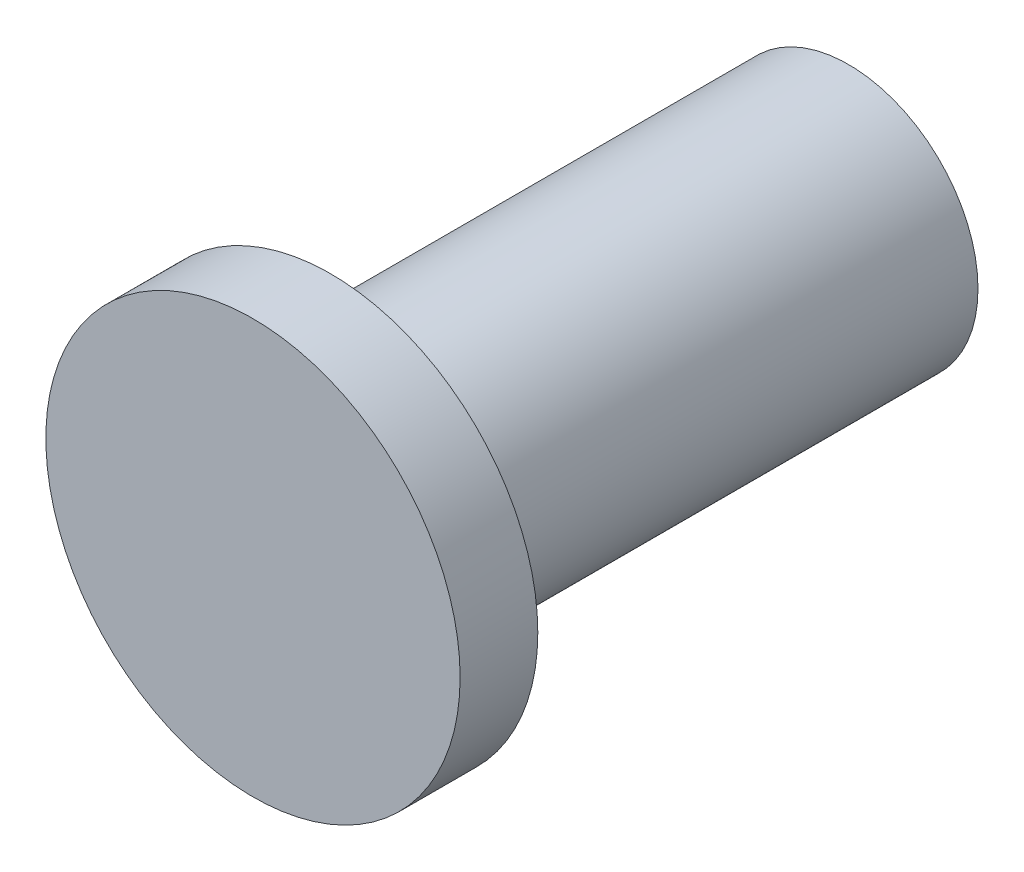
ISO-10303-21;
HEADER;
FILE_DESCRIPTION(('STEP AP214'),'2;1');
FILE_NAME('part.step','',(''),(''),'','','');
FILE_SCHEMA(('AUTOMOTIVE_DESIGN { 1 0 10303 214 1 1 1 1 }'));
ENDSEC;
DATA;
#1=APPLICATION_CONTEXT('core data for automotive mechanical design processes');
#2=APPLICATION_PROTOCOL_DEFINITION('international standard','automotive_design',2000,#1);
#3=PRODUCT_CONTEXT('',#1,'mechanical');
#4=PRODUCT('Part','Part','',(#3));
#5=PRODUCT_RELATED_PRODUCT_CATEGORY('part','',(#4));
#6=PRODUCT_DEFINITION_FORMATION('','',#4);
#7=PRODUCT_DEFINITION_CONTEXT('part definition',#1,'design');
#8=PRODUCT_DEFINITION('design','',#6,#7);
#9=PRODUCT_DEFINITION_SHAPE('','',#8);
#10=(LENGTH_UNIT() NAMED_UNIT(*) SI_UNIT(.MILLI.,.METRE.));
#11=(NAMED_UNIT(*) PLANE_ANGLE_UNIT() SI_UNIT($,.RADIAN.));
#12=(NAMED_UNIT(*) SI_UNIT($,.STERADIAN.) SOLID_ANGLE_UNIT());
#13=UNCERTAINTY_MEASURE_WITH_UNIT(LENGTH_MEASURE(1.E-05),#10,'distance_accuracy_value','');
#14=(GEOMETRIC_REPRESENTATION_CONTEXT(3) GLOBAL_UNCERTAINTY_ASSIGNED_CONTEXT((#13)) GLOBAL_UNIT_ASSIGNED_CONTEXT((#10,
#11,#12)) REPRESENTATION_CONTEXT('',''));
#15=CARTESIAN_POINT('',(0.,0.,0.));
#16=DIRECTION('',(0.,0.,1.));
#17=DIRECTION('',(1.,0.,0.));
#18=AXIS2_PLACEMENT_3D('',#15,#16,#17);
#19=CARTESIAN_POINT('',(0.,0.,3.));
#20=DIRECTION('',(0.,0.,-1.));
#21=DIRECTION('',(-1.,0.,0.));
#22=AXIS2_PLACEMENT_3D('',#19,#20,#21);
#23=CYLINDRICAL_SURFACE('',#22,8.);
#24=CARTESIAN_POINT('',(0.,0.,3.));
#25=DIRECTION('',(0.,0.,1.));
#26=DIRECTION('',(1.,0.,0.));
#27=AXIS2_PLACEMENT_3D('',#24,#25,#26);
#28=CIRCLE('',#27,8.);
#29=CARTESIAN_POINT('',(8.,0.,3.));
#30=VERTEX_POINT('',#29);
#31=EDGE_CURVE('E45',#30,#30,#28,.T.);
#32=ORIENTED_EDGE('',*,*,#31,.F.);
#33=EDGE_LOOP('',(#32));
#34=FACE_BOUND('',#33,.T.);
#35=CARTESIAN_POINT('',(0.,0.,0.));
#36=DIRECTION('',(0.,0.,1.));
#37=DIRECTION('',(1.,0.,0.));
#38=AXIS2_PLACEMENT_3D('',#35,#36,#37);
#39=CIRCLE('',#38,8.);
#40=CARTESIAN_POINT('',(8.,0.,0.));
#41=VERTEX_POINT('',#40);
#42=EDGE_CURVE('E40',#41,#41,#39,.T.);
#43=ORIENTED_EDGE('',*,*,#42,.T.);
#44=EDGE_LOOP('',(#43));
#45=FACE_BOUND('',#44,.T.);
#46=ADVANCED_FACE('F37',(#34,#45),#23,.T.);
#47=CARTESIAN_POINT('',(0.,0.,3.));
#48=DIRECTION('',(0.,0.,1.));
#49=DIRECTION('',(1.,0.,0.));
#50=AXIS2_PLACEMENT_3D('',#47,#48,#49);
#51=PLANE('',#50);
#52=ORIENTED_EDGE('',*,*,#31,.T.);
#53=EDGE_LOOP('',(#52));
#54=FACE_BOUND('',#53,.T.);
#55=ADVANCED_FACE('F65',(#54),#51,.T.);
#56=CARTESIAN_POINT('',(0.,0.,0.));
#57=DIRECTION('',(0.,0.,1.));
#58=DIRECTION('',(1.,0.,0.));
#59=AXIS2_PLACEMENT_3D('',#56,#57,#58);
#60=PLANE('',#59);
#61=CARTESIAN_POINT('',(0.,0.,0.));
#62=DIRECTION('',(0.,0.,-1.));
#63=DIRECTION('',(-1.,0.,0.));
#64=AXIS2_PLACEMENT_3D('',#61,#62,#63);
#65=CIRCLE('',#64,5.);
#66=CARTESIAN_POINT('',(-5.,0.,0.));
#67=VERTEX_POINT('',#66);
#68=EDGE_CURVE('E10',#67,#67,#65,.T.);
#69=ORIENTED_EDGE('',*,*,#68,.F.);
#70=EDGE_LOOP('',(#69));
#71=FACE_BOUND('',#70,.T.);
#72=ORIENTED_EDGE('',*,*,#42,.F.);
#73=EDGE_LOOP('',(#72));
#74=FACE_BOUND('',#73,.T.);
#75=ADVANCED_FACE('F62',(#71,#74),#60,.F.);
#76=CARTESIAN_POINT('',(0.,0.,-10.));
#77=DIRECTION('',(0.,0.,1.));
#78=DIRECTION('',(1.,0.,0.));
#79=AXIS2_PLACEMENT_3D('',#76,#77,#78);
#80=CYLINDRICAL_SURFACE('',#79,5.);
#81=ORIENTED_EDGE('',*,*,#68,.T.);
#82=EDGE_LOOP('',(#81));
#83=FACE_BOUND('',#82,.T.);
#84=CARTESIAN_POINT('',(0.,0.,-20.));
#85=DIRECTION('',(0.,0.,-1.));
#86=DIRECTION('',(-1.,0.,0.));
#87=AXIS2_PLACEMENT_3D('',#84,#85,#86);
#88=CIRCLE('',#87,5.);
#89=CARTESIAN_POINT('',(-5.,0.,-20.));
#90=VERTEX_POINT('',#89);
#91=EDGE_CURVE('E52',#90,#90,#88,.T.);
#92=ORIENTED_EDGE('',*,*,#91,.F.);
#93=EDGE_LOOP('',(#92));
#94=FACE_BOUND('',#93,.T.);
#95=ADVANCED_FACE('F64',(#83,#94),#80,.T.);
#96=CARTESIAN_POINT('',(0.,0.,-20.));
#97=DIRECTION('',(0.,0.,-1.));
#98=DIRECTION('',(-1.,0.,0.));
#99=AXIS2_PLACEMENT_3D('',#96,#97,#98);
#100=PLANE('',#99);
#101=ORIENTED_EDGE('',*,*,#91,.T.);
#102=EDGE_LOOP('',(#101));
#103=FACE_BOUND('',#102,.T.);
#104=ADVANCED_FACE('F71',(#103),#100,.T.);
#105=CLOSED_SHELL('',(#46,#55,#75,#95,#104));
#106=MANIFOLD_SOLID_BREP('B2',#105);
#107=ADVANCED_BREP_SHAPE_REPRESENTATION('',(#18,#106),#14);
#108=SHAPE_DEFINITION_REPRESENTATION(#9,#107);
ENDSEC;
END-ISO-10303-21;
